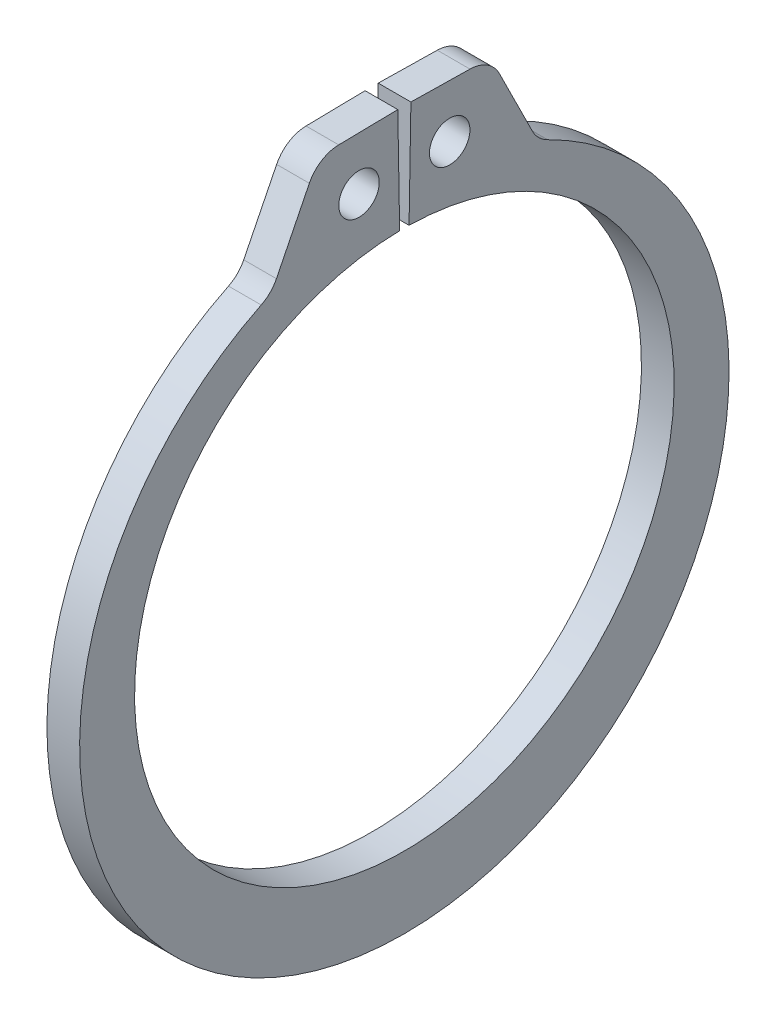
ISO-10303-21;
HEADER;
FILE_DESCRIPTION(('STEP AP214'),'2;1');
FILE_NAME('part.step','',(''),(''),'','','');
FILE_SCHEMA(('AUTOMOTIVE_DESIGN { 1 0 10303 214 1 1 1 1 }'));
ENDSEC;
DATA;
#1=APPLICATION_CONTEXT('core data for automotive mechanical design processes');
#2=APPLICATION_PROTOCOL_DEFINITION('international standard','automotive_design',2000,#1);
#3=PRODUCT_CONTEXT('',#1,'mechanical');
#4=PRODUCT('Part','Part','',(#3));
#5=PRODUCT_RELATED_PRODUCT_CATEGORY('part','',(#4));
#6=PRODUCT_DEFINITION_FORMATION('','',#4);
#7=PRODUCT_DEFINITION_CONTEXT('part definition',#1,'design');
#8=PRODUCT_DEFINITION('design','',#6,#7);
#9=PRODUCT_DEFINITION_SHAPE('','',#8);
#10=(LENGTH_UNIT() NAMED_UNIT(*) SI_UNIT(.MILLI.,.METRE.));
#11=(NAMED_UNIT(*) PLANE_ANGLE_UNIT() SI_UNIT($,.RADIAN.));
#12=(NAMED_UNIT(*) SI_UNIT($,.STERADIAN.) SOLID_ANGLE_UNIT());
#13=UNCERTAINTY_MEASURE_WITH_UNIT(LENGTH_MEASURE(1.E-05),#10,'distance_accuracy_value','');
#14=(GEOMETRIC_REPRESENTATION_CONTEXT(3) GLOBAL_UNCERTAINTY_ASSIGNED_CONTEXT((#13)) GLOBAL_UNIT_ASSIGNED_CONTEXT((#10,
#11,#12)) REPRESENTATION_CONTEXT('',''));
#15=CARTESIAN_POINT('',(0.,0.,0.));
#16=DIRECTION('',(0.,0.,1.));
#17=DIRECTION('',(1.,0.,0.));
#18=AXIS2_PLACEMENT_3D('',#15,#16,#17);
#19=CARTESIAN_POINT('',(0.533399999999989,0.,0.));
#20=DIRECTION('',(1.,0.,0.));
#21=DIRECTION('',(0.,0.,-1.));
#22=AXIS2_PLACEMENT_3D('',#19,#20,#21);
#23=PLANE('',#22);
#24=CARTESIAN_POINT('',(0.533399999999989,10.5040886416162,-1.47894687499924));
#25=DIRECTION('',(-1.,0.,0.));
#26=DIRECTION('',(0.,0.,1.));
#27=AXIS2_PLACEMENT_3D('',#24,#25,#26);
#28=CIRCLE('',#27,0.6604);
#29=CARTESIAN_POINT('',(0.533399999999989,10.5040886416162,-0.818546874999241));
#30=VERTEX_POINT('',#29);
#31=EDGE_CURVE('E107',#30,#30,#28,.T.);
#32=ORIENTED_EDGE('',*,*,#31,.T.);
#33=EDGE_LOOP('',(#32));
#34=FACE_BOUND('',#33,.T.);
#35=CARTESIAN_POINT('',(0.533399999999989,0.,0.));
#36=DIRECTION('',(-1.,0.,0.));
#37=DIRECTION('',(0.,0.,1.));
#38=AXIS2_PLACEMENT_3D('',#35,#36,#37);
#39=CIRCLE('',#38,8.8011);
#40=CARTESIAN_POINT('',(0.533399999999989,8.79975954984091,-0.153600374295177));
#41=VERTEX_POINT('',#40);
#42=CARTESIAN_POINT('',(0.533399999999989,8.79975954984091,0.153600374295175));
#43=VERTEX_POINT('',#42);
#44=EDGE_CURVE('E173',#41,#43,#39,.T.);
#45=ORIENTED_EDGE('',*,*,#44,.T.);
#46=DIRECTION('',(0.,-0.999847695156391,-0.0174524064372834));
#47=VECTOR('',#46,1.);
#48=CARTESIAN_POINT('',(0.533399999999989,8.79975954984091,0.153600374295175));
#49=LINE('',#48,#47);
#50=CARTESIAN_POINT('',(0.533399999999989,12.2536334279892,0.213887967092126));
#51=VERTEX_POINT('',#50);
#52=EDGE_CURVE('E123',#43,#51,#49,.F.);
#53=ORIENTED_EDGE('',*,*,#52,.T.);
#54=DIRECTION('',(0.,0.0174524064372834,-0.999847695156391));
#55=VECTOR('',#54,1.);
#56=CARTESIAN_POINT('',(0.533399999999989,12.2536334279892,0.213887967092126));
#57=LINE('',#56,#55);
#58=CARTESIAN_POINT('',(0.533399999999989,12.21999978275,2.14075821234738));
#59=VERTEX_POINT('',#58);
#60=EDGE_CURVE('E118',#51,#59,#57,.F.);
#61=ORIENTED_EDGE('',*,*,#60,.T.);
#62=CARTESIAN_POINT('',(0.533399999999989,11.1279661301002,2.12169669403658));
#63=DIRECTION('',(-1.,0.,0.));
#64=DIRECTION('',(0.,0.,1.));
#65=AXIS2_PLACEMENT_3D('',#62,#63,#64);
#66=CIRCLE('',#65,1.0922);
#67=CARTESIAN_POINT('',(0.533399999999989,11.6141614114107,3.09971253666458));
#68=VERTEX_POINT('',#67);
#69=EDGE_CURVE('E111',#68,#59,#66,.T.);
#70=ORIENTED_EDGE('',*,*,#69,.F.);
#71=DIRECTION('',(0.,0.895454900776411,-0.445152244378829));
#72=VECTOR('',#71,1.);
#73=CARTESIAN_POINT('',(0.533399999999989,12.2084177333914,2.80429337570331));
#74=LINE('',#73,#72);
#75=CARTESIAN_POINT('',(0.533399999999989,9.45539137797145,4.17288922557434));
#76=VERTEX_POINT('',#75);
#77=EDGE_CURVE('E106',#68,#76,#74,.F.);
#78=ORIENTED_EDGE('',*,*,#77,.T.);
#79=CARTESIAN_POINT('',(0.533399999999989,9.941586659282,5.15090506820234));
#80=DIRECTION('',(-1.,0.,0.));
#81=DIRECTION('',(0.,0.,1.));
#82=AXIS2_PLACEMENT_3D('',#79,#80,#81);
#83=CIRCLE('',#82,1.0922);
#84=CARTESIAN_POINT('',(0.533399999999989,8.96124610534802,4.66941442622431));
#85=VERTEX_POINT('',#84);
#86=EDGE_CURVE('E97',#76,#85,#83,.T.);
#87=ORIENTED_EDGE('',*,*,#86,.T.);
#88=CARTESIAN_POINT('',(0.533399999999989,-0.545929997486656,0.));
#89=DIRECTION('',(-1.,0.,0.));
#90=DIRECTION('',(0.,0.,1.));
#91=AXIS2_PLACEMENT_3D('',#88,#89,#90);
#92=CIRCLE('',#91,10.5919700025133);
#93=CARTESIAN_POINT('',(0.533399999999989,8.96124610534802,-4.66941442622431));
#94=VERTEX_POINT('',#93);
#95=EDGE_CURVE('E180',#94,#85,#92,.T.);
#96=ORIENTED_EDGE('',*,*,#95,.F.);
#97=CARTESIAN_POINT('',(0.533399999999989,9.941586659282,-5.15090506820234));
#98=DIRECTION('',(-1.,0.,0.));
#99=DIRECTION('',(0.,0.,1.));
#100=AXIS2_PLACEMENT_3D('',#97,#98,#99);
#101=CIRCLE('',#100,1.0922);
#102=CARTESIAN_POINT('',(0.533399999999989,9.45539137797145,-4.17288922557434));
#103=VERTEX_POINT('',#102);
#104=EDGE_CURVE('E177',#94,#103,#101,.T.);
#105=ORIENTED_EDGE('',*,*,#104,.T.);
#106=DIRECTION('',(0.,-0.895454900776411,-0.445152244378829));
#107=VECTOR('',#106,1.);
#108=CARTESIAN_POINT('',(0.533399999999989,12.2084177333914,-2.80429337570331));
#109=LINE('',#108,#107);
#110=CARTESIAN_POINT('',(0.533399999999989,11.6141614114107,-3.09971253666458));
#111=VERTEX_POINT('',#110);
#112=EDGE_CURVE('E142',#103,#111,#109,.F.);
#113=ORIENTED_EDGE('',*,*,#112,.T.);
#114=CARTESIAN_POINT('',(0.533399999999989,11.1279661301002,-2.12169669403658));
#115=DIRECTION('',(-1.,0.,0.));
#116=DIRECTION('',(0.,0.,1.));
#117=AXIS2_PLACEMENT_3D('',#114,#115,#116);
#118=CIRCLE('',#117,1.0922);
#119=CARTESIAN_POINT('',(0.533399999999989,12.21999978275,-2.14075821234738));
#120=VERTEX_POINT('',#119);
#121=EDGE_CURVE('E144',#120,#111,#118,.T.);
#122=ORIENTED_EDGE('',*,*,#121,.F.);
#123=DIRECTION('',(0.,-0.0174524064372835,-0.999847695156391));
#124=VECTOR('',#123,1.);
#125=CARTESIAN_POINT('',(0.533399999999989,12.2536334279892,-0.213887967092127));
#126=LINE('',#125,#124);
#127=CARTESIAN_POINT('',(0.533399999999989,12.2536334279892,-0.213887967092128));
#128=VERTEX_POINT('',#127);
#129=EDGE_CURVE('E136',#120,#128,#126,.F.);
#130=ORIENTED_EDGE('',*,*,#129,.T.);
#131=DIRECTION('',(0.,0.999847695156391,-0.0174524064372835));
#132=VECTOR('',#131,1.);
#133=CARTESIAN_POINT('',(0.533399999999989,8.79975954984091,-0.153600374295177));
#134=LINE('',#133,#132);
#135=EDGE_CURVE('E129',#128,#41,#134,.F.);
#136=ORIENTED_EDGE('',*,*,#135,.T.);
#137=EDGE_LOOP('',(#45,#53,#61,#70,#78,#87,#96,#105,#113,#122,#130,#136));
#138=FACE_BOUND('',#137,.T.);
#139=CARTESIAN_POINT('',(0.533399999999989,10.5040886416162,1.47894687499924));
#140=DIRECTION('',(-1.,0.,0.));
#141=DIRECTION('',(0.,0.,1.));
#142=AXIS2_PLACEMENT_3D('',#139,#140,#141);
#143=CIRCLE('',#142,0.6604);
#144=CARTESIAN_POINT('',(0.533399999999989,10.5040886416162,2.13934687499924));
#145=VERTEX_POINT('',#144);
#146=EDGE_CURVE('E19',#145,#145,#143,.T.);
#147=ORIENTED_EDGE('',*,*,#146,.T.);
#148=EDGE_LOOP('',(#147));
#149=FACE_BOUND('',#148,.T.);
#150=ADVANCED_FACE('F16',(#34,#138,#149),#23,.T.);
#151=CARTESIAN_POINT('',(0.533399999999989,10.5040886416162,1.47894687499924));
#152=DIRECTION('',(-1.,0.,0.));
#153=DIRECTION('',(0.,0.,1.));
#154=AXIS2_PLACEMENT_3D('',#151,#152,#153);
#155=CYLINDRICAL_SURFACE('',#154,0.6604);
#156=CARTESIAN_POINT('',(-0.533399999999989,10.5040886416162,1.47894687499924));
#157=DIRECTION('',(-1.,0.,0.));
#158=DIRECTION('',(0.,0.,1.));
#159=AXIS2_PLACEMENT_3D('',#156,#157,#158);
#160=CIRCLE('',#159,0.6604);
#161=CARTESIAN_POINT('',(-0.533399999999989,10.5040886416162,2.13934687499924));
#162=VERTEX_POINT('',#161);
#163=EDGE_CURVE('E167',#162,#162,#160,.T.);
#164=ORIENTED_EDGE('',*,*,#163,.T.);
#165=EDGE_LOOP('',(#164));
#166=FACE_BOUND('',#165,.T.);
#167=ORIENTED_EDGE('',*,*,#146,.F.);
#168=EDGE_LOOP('',(#167));
#169=FACE_BOUND('',#168,.T.);
#170=ADVANCED_FACE('F387',(#166,#169),#155,.F.);
#171=CARTESIAN_POINT('',(0.533399999999989,9.941586659282,5.15090506820234));
#172=DIRECTION('',(-1.,0.,0.));
#173=DIRECTION('',(0.,0.,1.));
#174=AXIS2_PLACEMENT_3D('',#171,#172,#173);
#175=CYLINDRICAL_SURFACE('',#174,1.0922);
#176=DIRECTION('',(1.,0.,0.));
#177=VECTOR('',#176,1.);
#178=CARTESIAN_POINT('',(0.533399999999989,9.45539137797145,4.17288922557434));
#179=LINE('',#178,#177);
#180=CARTESIAN_POINT('',(-0.533399999999989,9.45539137797145,4.17288922557434));
#181=VERTEX_POINT('',#180);
#182=EDGE_CURVE('E101',#76,#181,#179,.F.);
#183=ORIENTED_EDGE('',*,*,#182,.T.);
#184=CARTESIAN_POINT('',(-0.533399999999989,9.941586659282,5.15090506820234));
#185=DIRECTION('',(-1.,0.,0.));
#186=DIRECTION('',(0.,0.,1.));
#187=AXIS2_PLACEMENT_3D('',#184,#185,#186);
#188=CIRCLE('',#187,1.0922);
#189=CARTESIAN_POINT('',(-0.533399999999989,8.96124610534802,4.66941442622431));
#190=VERTEX_POINT('',#189);
#191=EDGE_CURVE('E165',#181,#190,#188,.T.);
#192=ORIENTED_EDGE('',*,*,#191,.T.);
#193=DIRECTION('',(-1.,0.,0.));
#194=VECTOR('',#193,1.);
#195=CARTESIAN_POINT('',(0.533399999999989,8.96124610534802,4.66941442622431));
#196=LINE('',#195,#194);
#197=EDGE_CURVE('E102',#85,#190,#196,.T.);
#198=ORIENTED_EDGE('',*,*,#197,.F.);
#199=ORIENTED_EDGE('',*,*,#86,.F.);
#200=EDGE_LOOP('',(#183,#192,#198,#199));
#201=FACE_BOUND('',#200,.T.);
#202=ADVANCED_FACE('F99',(#201),#175,.F.);
#203=CARTESIAN_POINT('',(0.533399999999989,-0.545929997486656,0.));
#204=DIRECTION('',(-1.,0.,0.));
#205=DIRECTION('',(0.,0.,1.));
#206=AXIS2_PLACEMENT_3D('',#203,#204,#205);
#207=CYLINDRICAL_SURFACE('',#206,10.5919700025133);
#208=CARTESIAN_POINT('',(-0.533399999999989,-0.545929997486656,0.));
#209=DIRECTION('',(-1.,0.,0.));
#210=DIRECTION('',(0.,0.,1.));
#211=AXIS2_PLACEMENT_3D('',#208,#209,#210);
#212=CIRCLE('',#211,10.5919700025133);
#213=CARTESIAN_POINT('',(-0.533399999999989,8.96124610534802,-4.66941442622431));
#214=VERTEX_POINT('',#213);
#215=EDGE_CURVE('E163',#190,#214,#212,.F.);
#216=ORIENTED_EDGE('',*,*,#215,.T.);
#217=DIRECTION('',(-1.,0.,0.));
#218=VECTOR('',#217,1.);
#219=CARTESIAN_POINT('',(0.533399999999989,8.96124610534802,-4.66941442622431));
#220=LINE('',#219,#218);
#221=EDGE_CURVE('E179',#214,#94,#220,.F.);
#222=ORIENTED_EDGE('',*,*,#221,.T.);
#223=ORIENTED_EDGE('',*,*,#95,.T.);
#224=ORIENTED_EDGE('',*,*,#197,.T.);
#225=EDGE_LOOP('',(#216,#222,#223,#224));
#226=FACE_BOUND('',#225,.T.);
#227=ADVANCED_FACE('F185',(#226),#207,.T.);
#228=CARTESIAN_POINT('',(0.533399999999989,9.941586659282,-5.15090506820234));
#229=DIRECTION('',(-1.,0.,0.));
#230=DIRECTION('',(0.,0.,1.));
#231=AXIS2_PLACEMENT_3D('',#228,#229,#230);
#232=CYLINDRICAL_SURFACE('',#231,1.0922);
#233=ORIENTED_EDGE('',*,*,#221,.F.);
#234=CARTESIAN_POINT('',(-0.533399999999989,9.941586659282,-5.15090506820234));
#235=DIRECTION('',(-1.,0.,0.));
#236=DIRECTION('',(0.,0.,1.));
#237=AXIS2_PLACEMENT_3D('',#234,#235,#236);
#238=CIRCLE('',#237,1.0922);
#239=CARTESIAN_POINT('',(-0.533399999999989,9.45539137797145,-4.17288922557434));
#240=VERTEX_POINT('',#239);
#241=EDGE_CURVE('E160',#214,#240,#238,.T.);
#242=ORIENTED_EDGE('',*,*,#241,.T.);
#243=DIRECTION('',(1.,0.,0.));
#244=VECTOR('',#243,1.);
#245=CARTESIAN_POINT('',(0.533399999999989,9.45539137797145,-4.17288922557434));
#246=LINE('',#245,#244);
#247=EDGE_CURVE('E145',#240,#103,#246,.T.);
#248=ORIENTED_EDGE('',*,*,#247,.T.);
#249=ORIENTED_EDGE('',*,*,#104,.F.);
#250=EDGE_LOOP('',(#233,#242,#248,#249));
#251=FACE_BOUND('',#250,.T.);
#252=ADVANCED_FACE('F197',(#251),#232,.F.);
#253=CARTESIAN_POINT('',(0.533399999999989,12.2084177333914,-2.80429337570331));
#254=DIRECTION('',(0.,-0.445152244378829,0.895454900776411));
#255=DIRECTION('',(0.,-0.895454900776411,-0.445152244378829));
#256=AXIS2_PLACEMENT_3D('',#253,#254,#255);
#257=PLANE('',#256);
#258=ORIENTED_EDGE('',*,*,#247,.F.);
#259=DIRECTION('',(0.,0.89545490077641,0.445152244378829));
#260=VECTOR('',#259,1.);
#261=CARTESIAN_POINT('',(-0.533399999999989,9.45539137797145,-4.17288922557434));
#262=LINE('',#261,#260);
#263=CARTESIAN_POINT('',(-0.533399999999989,11.6141614114107,-3.09971253666458));
#264=VERTEX_POINT('',#263);
#265=EDGE_CURVE('E159',#240,#264,#262,.T.);
#266=ORIENTED_EDGE('',*,*,#265,.T.);
#267=DIRECTION('',(-1.,0.,0.));
#268=VECTOR('',#267,1.);
#269=CARTESIAN_POINT('',(0.533399999999989,11.6141614114107,-3.09971253666458));
#270=LINE('',#269,#268);
#271=EDGE_CURVE('E176',#111,#264,#270,.T.);
#272=ORIENTED_EDGE('',*,*,#271,.F.);
#273=ORIENTED_EDGE('',*,*,#112,.F.);
#274=EDGE_LOOP('',(#258,#266,#272,#273));
#275=FACE_BOUND('',#274,.T.);
#276=ADVANCED_FACE('F202',(#275),#257,.F.);
#277=CARTESIAN_POINT('',(0.533399999999989,11.1279661301002,-2.12169669403658));
#278=DIRECTION('',(-1.,0.,0.));
#279=DIRECTION('',(0.,0.,1.));
#280=AXIS2_PLACEMENT_3D('',#277,#278,#279);
#281=CYLINDRICAL_SURFACE('',#280,1.0922);
#282=CARTESIAN_POINT('',(-0.533399999999989,11.1279661301002,-2.12169669403658));
#283=DIRECTION('',(-1.,0.,0.));
#284=DIRECTION('',(0.,0.,1.));
#285=AXIS2_PLACEMENT_3D('',#282,#283,#284);
#286=CIRCLE('',#285,1.0922);
#287=CARTESIAN_POINT('',(-0.533399999999989,12.21999978275,-2.14075821234738));
#288=VERTEX_POINT('',#287);
#289=EDGE_CURVE('E155',#264,#288,#286,.F.);
#290=ORIENTED_EDGE('',*,*,#289,.T.);
#291=DIRECTION('',(1.,0.,0.));
#292=VECTOR('',#291,1.);
#293=CARTESIAN_POINT('',(0.533399999999989,12.21999978275,-2.14075821234738));
#294=LINE('',#293,#292);
#295=EDGE_CURVE('E139',#288,#120,#294,.T.);
#296=ORIENTED_EDGE('',*,*,#295,.T.);
#297=ORIENTED_EDGE('',*,*,#121,.T.);
#298=ORIENTED_EDGE('',*,*,#271,.T.);
#299=EDGE_LOOP('',(#290,#296,#297,#298));
#300=FACE_BOUND('',#299,.T.);
#301=ADVANCED_FACE('F265',(#300),#281,.T.);
#302=CARTESIAN_POINT('',(0.533399999999989,12.2536334279892,-0.213887967092127));
#303=DIRECTION('',(0.,-0.999847695156391,0.0174524064372835));
#304=DIRECTION('',(0.,-0.0174524064372835,-0.999847695156391));
#305=AXIS2_PLACEMENT_3D('',#302,#303,#304);
#306=PLANE('',#305);
#307=ORIENTED_EDGE('',*,*,#295,.F.);
#308=DIRECTION('',(0.,0.0174524064372837,0.999847695156391));
#309=VECTOR('',#308,1.);
#310=CARTESIAN_POINT('',(-0.533399999999989,12.21999978275,-2.14075821234738));
#311=LINE('',#310,#309);
#312=CARTESIAN_POINT('',(-0.533399999999989,12.2536334279892,-0.213887967092128));
#313=VERTEX_POINT('',#312);
#314=EDGE_CURVE('E158',#288,#313,#311,.T.);
#315=ORIENTED_EDGE('',*,*,#314,.T.);
#316=DIRECTION('',(1.,0.,0.));
#317=VECTOR('',#316,1.);
#318=CARTESIAN_POINT('',(0.533399999999989,12.2536334279892,-0.213887967092129));
#319=LINE('',#318,#317);
#320=EDGE_CURVE('E133',#313,#128,#319,.T.);
#321=ORIENTED_EDGE('',*,*,#320,.T.);
#322=ORIENTED_EDGE('',*,*,#129,.F.);
#323=EDGE_LOOP('',(#307,#315,#321,#322));
#324=FACE_BOUND('',#323,.T.);
#325=ADVANCED_FACE('F263',(#324),#306,.F.);
#326=CARTESIAN_POINT('',(0.533399999999989,8.79975954984091,-0.153600374295177));
#327=DIRECTION('',(0.,-0.0174524064372835,-0.999847695156391));
#328=DIRECTION('',(0.,0.999847695156391,-0.0174524064372835));
#329=AXIS2_PLACEMENT_3D('',#326,#327,#328);
#330=PLANE('',#329);
#331=DIRECTION('',(-1.,0.,0.));
#332=VECTOR('',#331,1.);
#333=CARTESIAN_POINT('',(0.533399999999989,8.79975954984091,-0.153600374295178));
#334=LINE('',#333,#332);
#335=CARTESIAN_POINT('',(-0.533399999999989,8.79975954984091,-0.153600374295177));
#336=VERTEX_POINT('',#335);
#337=EDGE_CURVE('E132',#336,#41,#334,.F.);
#338=ORIENTED_EDGE('',*,*,#337,.T.);
#339=ORIENTED_EDGE('',*,*,#135,.F.);
#340=ORIENTED_EDGE('',*,*,#320,.F.);
#341=DIRECTION('',(0.,-0.999847695156391,0.017452406437283));
#342=VECTOR('',#341,1.);
#343=CARTESIAN_POINT('',(-0.533399999999989,12.2536334279892,-0.213887967092127));
#344=LINE('',#343,#342);
#345=EDGE_CURVE('E154',#313,#336,#344,.T.);
#346=ORIENTED_EDGE('',*,*,#345,.T.);
#347=EDGE_LOOP('',(#338,#339,#340,#346));
#348=FACE_BOUND('',#347,.T.);
#349=ADVANCED_FACE('F258',(#348),#330,.F.);
#350=CARTESIAN_POINT('',(0.533399999999989,0.,0.));
#351=DIRECTION('',(-1.,0.,0.));
#352=DIRECTION('',(0.,0.,1.));
#353=AXIS2_PLACEMENT_3D('',#350,#351,#352);
#354=CYLINDRICAL_SURFACE('',#353,8.8011);
#355=ORIENTED_EDGE('',*,*,#44,.F.);
#356=ORIENTED_EDGE('',*,*,#337,.F.);
#357=CARTESIAN_POINT('',(-0.533399999999989,0.,0.));
#358=DIRECTION('',(-1.,0.,0.));
#359=DIRECTION('',(0.,0.,1.));
#360=AXIS2_PLACEMENT_3D('',#357,#358,#359);
#361=CIRCLE('',#360,8.8011);
#362=CARTESIAN_POINT('',(-0.533399999999989,8.79975954984091,0.153600374295175));
#363=VERTEX_POINT('',#362);
#364=EDGE_CURVE('E151',#336,#363,#361,.T.);
#365=ORIENTED_EDGE('',*,*,#364,.T.);
#366=DIRECTION('',(1.,0.,0.));
#367=VECTOR('',#366,1.);
#368=CARTESIAN_POINT('',(0.533399999999989,8.79975954984091,0.153600374295175));
#369=LINE('',#368,#367);
#370=EDGE_CURVE('E126',#363,#43,#369,.T.);
#371=ORIENTED_EDGE('',*,*,#370,.T.);
#372=EDGE_LOOP('',(#355,#356,#365,#371));
#373=FACE_BOUND('',#372,.T.);
#374=ADVANCED_FACE('F253',(#373),#354,.F.);
#375=CARTESIAN_POINT('',(0.533399999999989,8.79975954984091,0.153600374295175));
#376=DIRECTION('',(0.,-0.0174524064372834,0.999847695156391));
#377=DIRECTION('',(0.,-0.999847695156391,-0.0174524064372834));
#378=AXIS2_PLACEMENT_3D('',#375,#376,#377);
#379=PLANE('',#378);
#380=DIRECTION('',(1.,0.,0.));
#381=VECTOR('',#380,1.);
#382=CARTESIAN_POINT('',(0.533399999999989,12.2536334279892,0.213887967092126));
#383=LINE('',#382,#381);
#384=CARTESIAN_POINT('',(-0.533399999999989,12.2536334279892,0.213887967092126));
#385=VERTEX_POINT('',#384);
#386=EDGE_CURVE('E120',#385,#51,#383,.T.);
#387=ORIENTED_EDGE('',*,*,#386,.T.);
#388=ORIENTED_EDGE('',*,*,#52,.F.);
#389=ORIENTED_EDGE('',*,*,#370,.F.);
#390=DIRECTION('',(0.,0.999847695156391,0.0174524064372833));
#391=VECTOR('',#390,1.);
#392=CARTESIAN_POINT('',(-0.533399999999989,8.79975954984091,0.153600374295175));
#393=LINE('',#392,#391);
#394=EDGE_CURVE('E153',#363,#385,#393,.T.);
#395=ORIENTED_EDGE('',*,*,#394,.T.);
#396=EDGE_LOOP('',(#387,#388,#389,#395));
#397=FACE_BOUND('',#396,.T.);
#398=ADVANCED_FACE('F250',(#397),#379,.F.);
#399=CARTESIAN_POINT('',(0.533399999999989,12.2536334279892,0.213887967092126));
#400=DIRECTION('',(0.,-0.999847695156391,-0.0174524064372834));
#401=DIRECTION('',(0.,0.0174524064372834,-0.999847695156391));
#402=AXIS2_PLACEMENT_3D('',#399,#400,#401);
#403=PLANE('',#402);
#404=DIRECTION('',(-1.,0.,0.));
#405=VECTOR('',#404,1.);
#406=CARTESIAN_POINT('',(0.533399999999989,12.21999978275,2.14075821234738));
#407=LINE('',#406,#405);
#408=CARTESIAN_POINT('',(-0.533399999999989,12.21999978275,2.14075821234738));
#409=VERTEX_POINT('',#408);
#410=EDGE_CURVE('E113',#59,#409,#407,.T.);
#411=ORIENTED_EDGE('',*,*,#410,.F.);
#412=ORIENTED_EDGE('',*,*,#60,.F.);
#413=ORIENTED_EDGE('',*,*,#386,.F.);
#414=DIRECTION('',(0.,-0.0174524064372828,0.999847695156391));
#415=VECTOR('',#414,1.);
#416=CARTESIAN_POINT('',(-0.533399999999989,12.2536334279892,0.213887967092126));
#417=LINE('',#416,#415);
#418=EDGE_CURVE('E150',#385,#409,#417,.T.);
#419=ORIENTED_EDGE('',*,*,#418,.T.);
#420=EDGE_LOOP('',(#411,#412,#413,#419));
#421=FACE_BOUND('',#420,.T.);
#422=ADVANCED_FACE('F243',(#421),#403,.F.);
#423=CARTESIAN_POINT('',(0.533399999999989,11.1279661301002,2.12169669403658));
#424=DIRECTION('',(-1.,0.,0.));
#425=DIRECTION('',(0.,0.,1.));
#426=AXIS2_PLACEMENT_3D('',#423,#424,#425);
#427=CYLINDRICAL_SURFACE('',#426,1.0922);
#428=CARTESIAN_POINT('',(-0.533399999999989,11.1279661301002,2.12169669403658));
#429=DIRECTION('',(-1.,0.,0.));
#430=DIRECTION('',(0.,0.,1.));
#431=AXIS2_PLACEMENT_3D('',#428,#429,#430);
#432=CIRCLE('',#431,1.0922);
#433=CARTESIAN_POINT('',(-0.533399999999989,11.6141614114107,3.09971253666458));
#434=VERTEX_POINT('',#433);
#435=EDGE_CURVE('E147',#409,#434,#432,.F.);
#436=ORIENTED_EDGE('',*,*,#435,.T.);
#437=DIRECTION('',(1.,0.,0.));
#438=VECTOR('',#437,1.);
#439=CARTESIAN_POINT('',(0.533399999999989,11.6141614114107,3.09971253666458));
#440=LINE('',#439,#438);
#441=EDGE_CURVE('E34',#434,#68,#440,.T.);
#442=ORIENTED_EDGE('',*,*,#441,.T.);
#443=ORIENTED_EDGE('',*,*,#69,.T.);
#444=ORIENTED_EDGE('',*,*,#410,.T.);
#445=EDGE_LOOP('',(#436,#442,#443,#444));
#446=FACE_BOUND('',#445,.T.);
#447=ADVANCED_FACE('F288',(#446),#427,.T.);
#448=CARTESIAN_POINT('',(0.533399999999989,12.2084177333914,2.80429337570331));
#449=DIRECTION('',(0.,-0.445152244378829,-0.895454900776411));
#450=DIRECTION('',(0.,0.895454900776411,-0.445152244378829));
#451=AXIS2_PLACEMENT_3D('',#448,#449,#450);
#452=PLANE('',#451);
#453=ORIENTED_EDGE('',*,*,#182,.F.);
#454=ORIENTED_EDGE('',*,*,#77,.F.);
#455=ORIENTED_EDGE('',*,*,#441,.F.);
#456=DIRECTION('',(0.,-0.895454900776411,0.445152244378828));
#457=VECTOR('',#456,1.);
#458=CARTESIAN_POINT('',(-0.533399999999989,11.6141614114107,3.09971253666458));
#459=LINE('',#458,#457);
#460=EDGE_CURVE('E25',#434,#181,#459,.T.);
#461=ORIENTED_EDGE('',*,*,#460,.T.);
#462=EDGE_LOOP('',(#453,#454,#455,#461));
#463=FACE_BOUND('',#462,.T.);
#464=ADVANCED_FACE('F105',(#463),#452,.F.);
#465=CARTESIAN_POINT('',(0.533399999999989,10.5040886416162,-1.47894687499924));
#466=DIRECTION('',(-1.,0.,0.));
#467=DIRECTION('',(0.,0.,1.));
#468=AXIS2_PLACEMENT_3D('',#465,#466,#467);
#469=CYLINDRICAL_SURFACE('',#468,0.6604);
#470=CARTESIAN_POINT('',(-0.533399999999989,10.5040886416162,-1.47894687499924));
#471=DIRECTION('',(-1.,0.,0.));
#472=DIRECTION('',(0.,0.,1.));
#473=AXIS2_PLACEMENT_3D('',#470,#471,#472);
#474=CIRCLE('',#473,0.6604);
#475=CARTESIAN_POINT('',(-0.533399999999989,10.5040886416162,-0.818546874999241));
#476=VERTEX_POINT('',#475);
#477=EDGE_CURVE('E11',#476,#476,#474,.T.);
#478=ORIENTED_EDGE('',*,*,#477,.T.);
#479=EDGE_LOOP('',(#478));
#480=FACE_BOUND('',#479,.T.);
#481=ORIENTED_EDGE('',*,*,#31,.F.);
#482=EDGE_LOOP('',(#481));
#483=FACE_BOUND('',#482,.T.);
#484=ADVANCED_FACE('F276',(#480,#483),#469,.F.);
#485=CARTESIAN_POINT('',(-0.533399999999989,0.,0.));
#486=DIRECTION('',(1.,0.,0.));
#487=DIRECTION('',(0.,0.,-1.));
#488=AXIS2_PLACEMENT_3D('',#485,#486,#487);
#489=PLANE('',#488);
#490=ORIENTED_EDGE('',*,*,#477,.F.);
#491=EDGE_LOOP('',(#490));
#492=FACE_BOUND('',#491,.T.);
#493=ORIENTED_EDGE('',*,*,#435,.F.);
#494=ORIENTED_EDGE('',*,*,#418,.F.);
#495=ORIENTED_EDGE('',*,*,#394,.F.);
#496=ORIENTED_EDGE('',*,*,#364,.F.);
#497=ORIENTED_EDGE('',*,*,#345,.F.);
#498=ORIENTED_EDGE('',*,*,#314,.F.);
#499=ORIENTED_EDGE('',*,*,#289,.F.);
#500=ORIENTED_EDGE('',*,*,#265,.F.);
#501=ORIENTED_EDGE('',*,*,#241,.F.);
#502=ORIENTED_EDGE('',*,*,#215,.F.);
#503=ORIENTED_EDGE('',*,*,#191,.F.);
#504=ORIENTED_EDGE('',*,*,#460,.F.);
#505=EDGE_LOOP('',(#493,#494,#495,#496,#497,#498,#499,#500,#501,#502,#503,#504));
#506=FACE_BOUND('',#505,.T.);
#507=ORIENTED_EDGE('',*,*,#163,.F.);
#508=EDGE_LOOP('',(#507));
#509=FACE_BOUND('',#508,.T.);
#510=ADVANCED_FACE('F190',(#492,#506,#509),#489,.F.);
#511=CLOSED_SHELL('',(#150,#170,#202,#227,#252,#276,#301,#325,#349,#374,#398,#422,#447,#464,
#484,#510));
#512=MANIFOLD_SOLID_BREP('B1',#511);
#513=ADVANCED_BREP_SHAPE_REPRESENTATION('',(#18,#512),#14);
#514=SHAPE_DEFINITION_REPRESENTATION(#9,#513);
ENDSEC;
END-ISO-10303-21;
